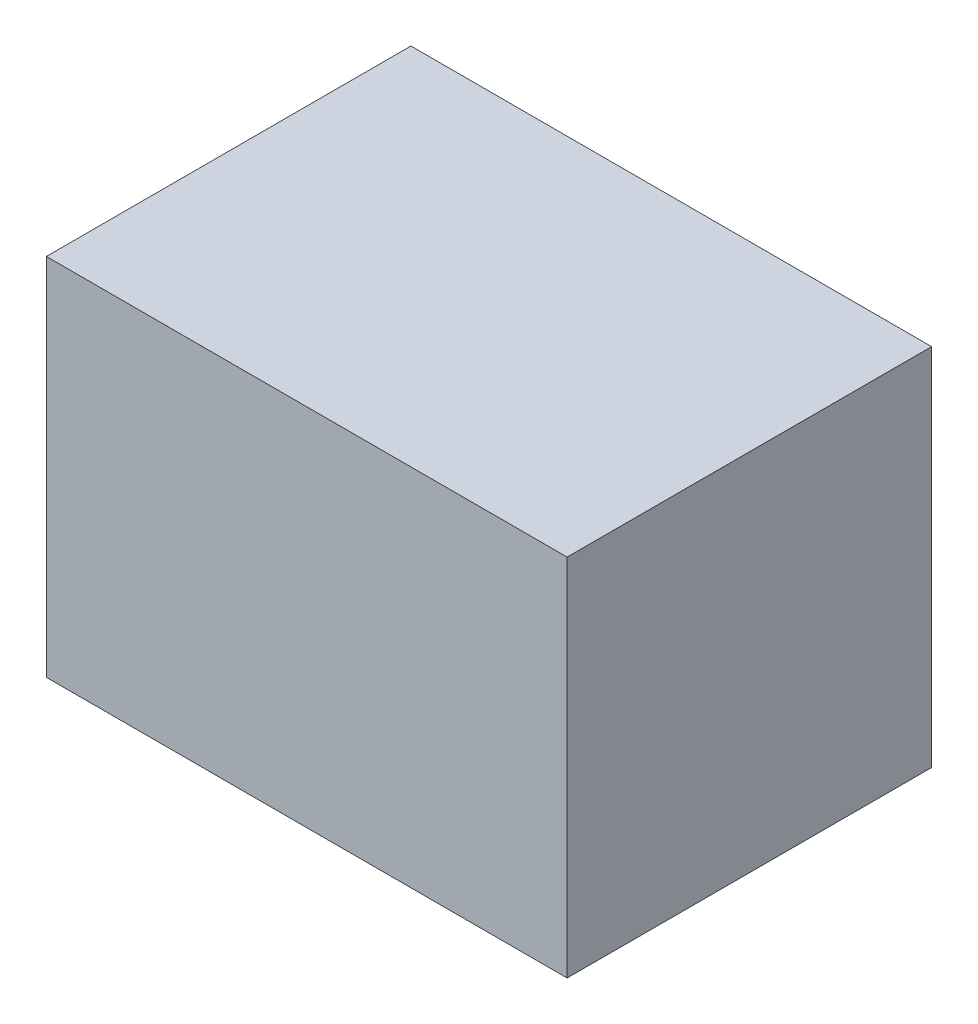
ISO-10303-21;
HEADER;
FILE_DESCRIPTION(('STEP AP214'),'2;1');
FILE_NAME('part.step','',(''),(''),'','','');
FILE_SCHEMA(('AUTOMOTIVE_DESIGN { 1 0 10303 214 1 1 1 1 }'));
ENDSEC;
DATA;
#1=APPLICATION_CONTEXT('core data for automotive mechanical design processes');
#2=APPLICATION_PROTOCOL_DEFINITION('international standard','automotive_design',2000,#1);
#3=PRODUCT_CONTEXT('',#1,'mechanical');
#4=PRODUCT('Part','Part','',(#3));
#5=PRODUCT_RELATED_PRODUCT_CATEGORY('part','',(#4));
#6=PRODUCT_DEFINITION_FORMATION('','',#4);
#7=PRODUCT_DEFINITION_CONTEXT('part definition',#1,'design');
#8=PRODUCT_DEFINITION('design','',#6,#7);
#9=PRODUCT_DEFINITION_SHAPE('','',#8);
#10=(LENGTH_UNIT() NAMED_UNIT(*) SI_UNIT(.MILLI.,.METRE.));
#11=(NAMED_UNIT(*) PLANE_ANGLE_UNIT() SI_UNIT($,.RADIAN.));
#12=(NAMED_UNIT(*) SI_UNIT($,.STERADIAN.) SOLID_ANGLE_UNIT());
#13=UNCERTAINTY_MEASURE_WITH_UNIT(LENGTH_MEASURE(1.E-05),#10,'distance_accuracy_value','');
#14=(GEOMETRIC_REPRESENTATION_CONTEXT(3) GLOBAL_UNCERTAINTY_ASSIGNED_CONTEXT((#13)) GLOBAL_UNIT_ASSIGNED_CONTEXT((#10,
#11,#12)) REPRESENTATION_CONTEXT('',''));
#15=CARTESIAN_POINT('',(0.,0.,0.));
#16=DIRECTION('',(0.,0.,1.));
#17=DIRECTION('',(1.,0.,0.));
#18=AXIS2_PLACEMENT_3D('',#15,#16,#17);
#19=CARTESIAN_POINT('',(-7.62,0.,0.));
#20=DIRECTION('',(0.,-1.,0.));
#21=DIRECTION('',(0.,0.,-1.));
#22=AXIS2_PLACEMENT_3D('',#19,#20,#21);
#23=PLANE('',#22);
#24=DIRECTION('',(1.,0.,0.));
#25=VECTOR('',#24,1.);
#26=CARTESIAN_POINT('',(-7.62,0.,-1.1));
#27=LINE('',#26,#25);
#28=CARTESIAN_POINT('',(7.37,0.,-1.1));
#29=VERTEX_POINT('',#28);
#30=CARTESIAN_POINT('',(7.87,0.,-1.1));
#31=VERTEX_POINT('',#30);
#32=EDGE_CURVE('E87',#29,#31,#27,.T.);
#33=ORIENTED_EDGE('',*,*,#32,.F.);
#34=DIRECTION('',(0.,0.,1.));
#35=VECTOR('',#34,1.);
#36=CARTESIAN_POINT('',(7.37,0.,0.));
#37=LINE('',#36,#35);
#38=CARTESIAN_POINT('',(7.37,0.,-0.75));
#39=VERTEX_POINT('',#38);
#40=EDGE_CURVE('E27',#29,#39,#37,.T.);
#41=ORIENTED_EDGE('',*,*,#40,.T.);
#42=DIRECTION('',(1.,0.,0.));
#43=VECTOR('',#42,1.);
#44=CARTESIAN_POINT('',(-7.62,0.,-0.75));
#45=LINE('',#44,#43);
#46=CARTESIAN_POINT('',(7.87,0.,-0.75));
#47=VERTEX_POINT('',#46);
#48=EDGE_CURVE('E105',#39,#47,#45,.T.);
#49=ORIENTED_EDGE('',*,*,#48,.T.);
#50=DIRECTION('',(0.,0.,1.));
#51=VECTOR('',#50,1.);
#52=CARTESIAN_POINT('',(7.87,0.,0.));
#53=LINE('',#52,#51);
#54=EDGE_CURVE('E67',#31,#47,#53,.T.);
#55=ORIENTED_EDGE('',*,*,#54,.F.);
#56=EDGE_LOOP('',(#33,#41,#49,#55));
#57=FACE_BOUND('',#56,.T.);
#58=ADVANCED_FACE('F16',(#57),#23,.F.);
#59=CARTESIAN_POINT('',(-7.62,-0.35,0.));
#60=DIRECTION('',(0.,-1.,0.));
#61=DIRECTION('',(0.,0.,-1.));
#62=AXIS2_PLACEMENT_3D('',#59,#60,#61);
#63=PLANE('',#62);
#64=DIRECTION('',(1.,0.,0.));
#65=VECTOR('',#64,1.);
#66=CARTESIAN_POINT('',(-7.62,-0.35,-1.1));
#67=LINE('',#66,#65);
#68=CARTESIAN_POINT('',(7.37,-0.35,-1.1));
#69=VERTEX_POINT('',#68);
#70=CARTESIAN_POINT('',(7.87,-0.35,-1.1));
#71=VERTEX_POINT('',#70);
#72=EDGE_CURVE('E89',#69,#71,#67,.T.);
#73=ORIENTED_EDGE('',*,*,#72,.T.);
#74=DIRECTION('',(0.,0.,1.));
#75=VECTOR('',#74,1.);
#76=CARTESIAN_POINT('',(7.87,-0.35,0.));
#77=LINE('',#76,#75);
#78=CARTESIAN_POINT('',(7.87,-0.35,-0.75));
#79=VERTEX_POINT('',#78);
#80=EDGE_CURVE('E103',#71,#79,#77,.T.);
#81=ORIENTED_EDGE('',*,*,#80,.T.);
#82=DIRECTION('',(1.,0.,0.));
#83=VECTOR('',#82,1.);
#84=CARTESIAN_POINT('',(-7.62,-0.35,-0.75));
#85=LINE('',#84,#83);
#86=CARTESIAN_POINT('',(7.37,-0.35,-0.75));
#87=VERTEX_POINT('',#86);
#88=EDGE_CURVE('E81',#87,#79,#85,.T.);
#89=ORIENTED_EDGE('',*,*,#88,.F.);
#90=DIRECTION('',(0.,0.,1.));
#91=VECTOR('',#90,1.);
#92=CARTESIAN_POINT('',(7.37,-0.35,0.));
#93=LINE('',#92,#91);
#94=EDGE_CURVE('E11',#69,#87,#93,.T.);
#95=ORIENTED_EDGE('',*,*,#94,.F.);
#96=EDGE_LOOP('',(#73,#81,#89,#95));
#97=FACE_BOUND('',#96,.T.);
#98=ADVANCED_FACE('F116',(#97),#63,.T.);
#99=CARTESIAN_POINT('',(7.37,-0.35,0.));
#100=DIRECTION('',(-1.,0.,0.));
#101=DIRECTION('',(0.,0.,1.));
#102=AXIS2_PLACEMENT_3D('',#99,#100,#101);
#103=PLANE('',#102);
#104=ORIENTED_EDGE('',*,*,#40,.F.);
#105=DIRECTION('',(0.,1.,0.));
#106=VECTOR('',#105,1.);
#107=CARTESIAN_POINT('',(7.37,-0.35,-1.1));
#108=LINE('',#107,#106);
#109=EDGE_CURVE('E75',#69,#29,#108,.T.);
#110=ORIENTED_EDGE('',*,*,#109,.F.);
#111=ORIENTED_EDGE('',*,*,#94,.T.);
#112=DIRECTION('',(0.,1.,0.));
#113=VECTOR('',#112,1.);
#114=CARTESIAN_POINT('',(7.37,-0.35,-0.75));
#115=LINE('',#114,#113);
#116=EDGE_CURVE('E78',#87,#39,#115,.T.);
#117=ORIENTED_EDGE('',*,*,#116,.T.);
#118=EDGE_LOOP('',(#104,#110,#111,#117));
#119=FACE_BOUND('',#118,.T.);
#120=ADVANCED_FACE('F74',(#119),#103,.T.);
#121=CARTESIAN_POINT('',(-7.62,-0.35,-0.75));
#122=DIRECTION('',(0.,0.,1.));
#123=DIRECTION('',(1.,0.,0.));
#124=AXIS2_PLACEMENT_3D('',#121,#122,#123);
#125=PLANE('',#124);
#126=ORIENTED_EDGE('',*,*,#48,.F.);
#127=ORIENTED_EDGE('',*,*,#116,.F.);
#128=ORIENTED_EDGE('',*,*,#88,.T.);
#129=DIRECTION('',(0.,1.,0.));
#130=VECTOR('',#129,1.);
#131=CARTESIAN_POINT('',(7.87,-0.35,-0.75));
#132=LINE('',#131,#130);
#133=EDGE_CURVE('E20',#79,#47,#132,.T.);
#134=ORIENTED_EDGE('',*,*,#133,.T.);
#135=EDGE_LOOP('',(#126,#127,#128,#134));
#136=FACE_BOUND('',#135,.T.);
#137=ADVANCED_FACE('F113',(#136),#125,.T.);
#138=CARTESIAN_POINT('',(7.87,-0.35,0.));
#139=DIRECTION('',(-1.,0.,0.));
#140=DIRECTION('',(0.,0.,1.));
#141=AXIS2_PLACEMENT_3D('',#138,#139,#140);
#142=PLANE('',#141);
#143=ORIENTED_EDGE('',*,*,#54,.T.);
#144=ORIENTED_EDGE('',*,*,#133,.F.);
#145=ORIENTED_EDGE('',*,*,#80,.F.);
#146=DIRECTION('',(0.,1.,0.));
#147=VECTOR('',#146,1.);
#148=CARTESIAN_POINT('',(7.87,-0.35,-1.1));
#149=LINE('',#148,#147);
#150=EDGE_CURVE('E93',#71,#31,#149,.T.);
#151=ORIENTED_EDGE('',*,*,#150,.T.);
#152=EDGE_LOOP('',(#143,#144,#145,#151));
#153=FACE_BOUND('',#152,.T.);
#154=ADVANCED_FACE('F18',(#153),#142,.F.);
#155=CARTESIAN_POINT('',(-7.62,-0.35,-1.1));
#156=DIRECTION('',(0.,0.,1.));
#157=DIRECTION('',(1.,0.,0.));
#158=AXIS2_PLACEMENT_3D('',#155,#156,#157);
#159=PLANE('',#158);
#160=ORIENTED_EDGE('',*,*,#32,.T.);
#161=ORIENTED_EDGE('',*,*,#150,.F.);
#162=ORIENTED_EDGE('',*,*,#72,.F.);
#163=ORIENTED_EDGE('',*,*,#109,.T.);
#164=EDGE_LOOP('',(#160,#161,#162,#163));
#165=FACE_BOUND('',#164,.T.);
#166=ADVANCED_FACE('F85',(#165),#159,.F.);
#167=CLOSED_SHELL('',(#58,#98,#120,#137,#154,#166));
#168=MANIFOLD_SOLID_BREP('B1',#167);
#169=ADVANCED_BREP_SHAPE_REPRESENTATION('',(#18,#168),#14);
#170=SHAPE_DEFINITION_REPRESENTATION(#9,#169);
ENDSEC;
END-ISO-10303-21;
